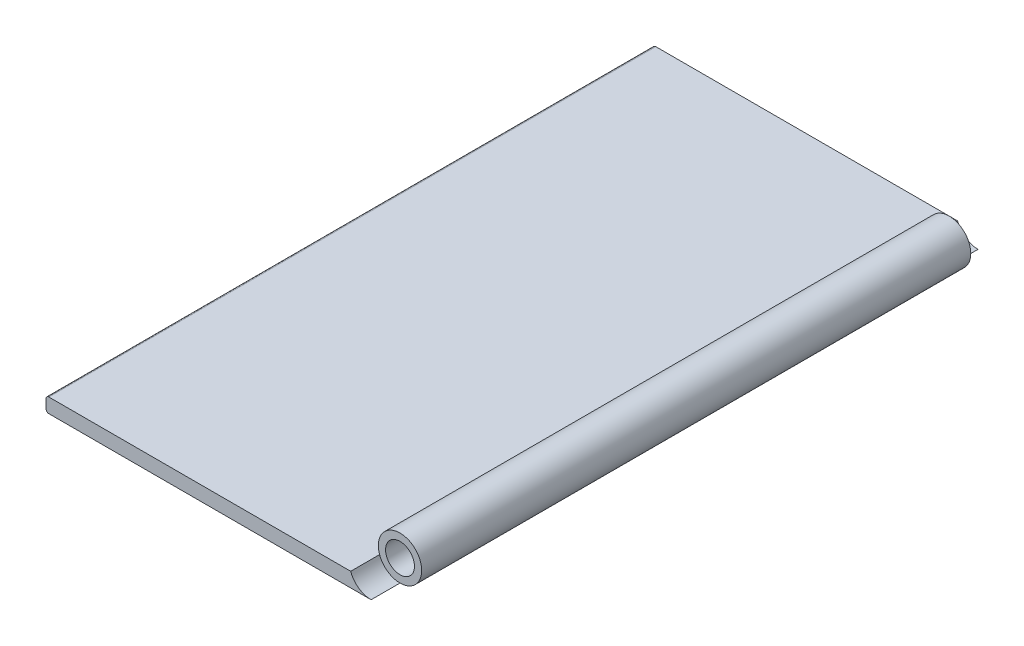
ISO-10303-21;
HEADER;
FILE_DESCRIPTION(('STEP AP214'),'2;1');
FILE_NAME('part.step','',(''),(''),'','','');
FILE_SCHEMA(('AUTOMOTIVE_DESIGN { 1 0 10303 214 1 1 1 1 }'));
ENDSEC;
DATA;
#1=APPLICATION_CONTEXT('core data for automotive mechanical design processes');
#2=APPLICATION_PROTOCOL_DEFINITION('international standard','automotive_design',2000,#1);
#3=PRODUCT_CONTEXT('',#1,'mechanical');
#4=PRODUCT('Part','Part','',(#3));
#5=PRODUCT_RELATED_PRODUCT_CATEGORY('part','',(#4));
#6=PRODUCT_DEFINITION_FORMATION('','',#4);
#7=PRODUCT_DEFINITION_CONTEXT('part definition',#1,'design');
#8=PRODUCT_DEFINITION('design','',#6,#7);
#9=PRODUCT_DEFINITION_SHAPE('','',#8);
#10=(LENGTH_UNIT() NAMED_UNIT(*) SI_UNIT(.MILLI.,.METRE.));
#11=(NAMED_UNIT(*) PLANE_ANGLE_UNIT() SI_UNIT($,.RADIAN.));
#12=(NAMED_UNIT(*) SI_UNIT($,.STERADIAN.) SOLID_ANGLE_UNIT());
#13=UNCERTAINTY_MEASURE_WITH_UNIT(LENGTH_MEASURE(1.E-05),#10,'distance_accuracy_value','');
#14=(GEOMETRIC_REPRESENTATION_CONTEXT(3) GLOBAL_UNCERTAINTY_ASSIGNED_CONTEXT((#13)) GLOBAL_UNIT_ASSIGNED_CONTEXT((#10,
#11,#12)) REPRESENTATION_CONTEXT('',''));
#15=CARTESIAN_POINT('',(0.,0.,0.));
#16=DIRECTION('',(0.,0.,1.));
#17=DIRECTION('',(1.,0.,0.));
#18=AXIS2_PLACEMENT_3D('',#15,#16,#17);
#19=CARTESIAN_POINT('',(112.5,7.5,210.));
#20=DIRECTION('',(0.,0.,-1.));
#21=DIRECTION('',(-1.,0.,0.));
#22=AXIS2_PLACEMENT_3D('',#19,#20,#21);
#23=CYLINDRICAL_SURFACE('',#22,7.50000000000001);
#24=CARTESIAN_POINT('',(112.5,7.5,10.));
#25=DIRECTION('',(0.,0.,-1.));
#26=DIRECTION('',(-1.,0.,0.));
#27=AXIS2_PLACEMENT_3D('',#24,#25,#26);
#28=CIRCLE('',#27,7.50000000000001);
#29=CARTESIAN_POINT('',(105.428932188123,5.00000000003196,10.));
#30=VERTEX_POINT('',#29);
#31=CARTESIAN_POINT('',(112.5,0.,10.));
#32=VERTEX_POINT('',#31);
#33=EDGE_CURVE('E158',#30,#32,#28,.T.);
#34=ORIENTED_EDGE('',*,*,#33,.F.);
#35=DIRECTION('',(0.,0.,-1.));
#36=VECTOR('',#35,1.);
#37=CARTESIAN_POINT('',(105.428932188123,5.00000000003196,210.));
#38=LINE('',#37,#36);
#39=CARTESIAN_POINT('',(105.428932188123,5.00000000003196,200.));
#40=VERTEX_POINT('',#39);
#41=EDGE_CURVE('E135',#40,#30,#38,.T.);
#42=ORIENTED_EDGE('',*,*,#41,.F.);
#43=CARTESIAN_POINT('',(112.5,7.5,200.));
#44=DIRECTION('',(0.,0.,1.));
#45=DIRECTION('',(1.,0.,0.));
#46=AXIS2_PLACEMENT_3D('',#43,#44,#45);
#47=CIRCLE('',#46,7.50000000000001);
#48=CARTESIAN_POINT('',(112.5,0.,200.));
#49=VERTEX_POINT('',#48);
#50=EDGE_CURVE('E155',#49,#40,#47,.T.);
#51=ORIENTED_EDGE('',*,*,#50,.F.);
#52=DIRECTION('',(0.,0.,-1.));
#53=VECTOR('',#52,1.);
#54=CARTESIAN_POINT('',(112.5,0.,210.));
#55=LINE('',#54,#53);
#56=EDGE_CURVE('E45',#49,#32,#55,.T.);
#57=ORIENTED_EDGE('',*,*,#56,.T.);
#58=EDGE_LOOP('',(#34,#42,#51,#57));
#59=FACE_BOUND('',#58,.T.);
#60=ADVANCED_FACE('F35',(#59),#23,.T.);
#61=CARTESIAN_POINT('',(112.5,7.5,210.));
#62=DIRECTION('',(0.,0.,-1.));
#63=DIRECTION('',(-1.,0.,0.));
#64=AXIS2_PLACEMENT_3D('',#61,#62,#63);
#65=CYLINDRICAL_SURFACE('',#64,5.);
#66=CARTESIAN_POINT('',(112.5,7.5,200.));
#67=DIRECTION('',(0.,0.,1.));
#68=DIRECTION('',(1.,0.,0.));
#69=AXIS2_PLACEMENT_3D('',#66,#67,#68);
#70=CIRCLE('',#69,5.);
#71=CARTESIAN_POINT('',(117.5,7.5,200.));
#72=VERTEX_POINT('',#71);
#73=EDGE_CURVE('E39',#72,#72,#70,.T.);
#74=ORIENTED_EDGE('',*,*,#73,.T.);
#75=EDGE_LOOP('',(#74));
#76=FACE_BOUND('',#75,.T.);
#77=CARTESIAN_POINT('',(112.5,7.5,10.));
#78=DIRECTION('',(0.,0.,-1.));
#79=DIRECTION('',(-1.,0.,0.));
#80=AXIS2_PLACEMENT_3D('',#77,#78,#79);
#81=CIRCLE('',#80,5.);
#82=CARTESIAN_POINT('',(107.5,7.5,10.));
#83=VERTEX_POINT('',#82);
#84=EDGE_CURVE('E178',#83,#83,#81,.T.);
#85=ORIENTED_EDGE('',*,*,#84,.T.);
#86=EDGE_LOOP('',(#85));
#87=FACE_BOUND('',#86,.T.);
#88=ADVANCED_FACE('F203',(#76,#87),#65,.F.);
#89=CARTESIAN_POINT('',(0.,0.,210.));
#90=DIRECTION('',(0.,1.,0.));
#91=DIRECTION('',(0.,0.,1.));
#92=AXIS2_PLACEMENT_3D('',#89,#90,#91);
#93=PLANE('',#92);
#94=DIRECTION('',(1.,0.,0.));
#95=VECTOR('',#94,1.);
#96=CARTESIAN_POINT('',(0.,0.,0.));
#97=LINE('',#96,#95);
#98=CARTESIAN_POINT('',(1.,0.,0.));
#99=VERTEX_POINT('',#98);
#100=CARTESIAN_POINT('',(112.5,0.,0.));
#101=VERTEX_POINT('',#100);
#102=EDGE_CURVE('E120',#99,#101,#97,.T.);
#103=ORIENTED_EDGE('',*,*,#102,.T.);
#104=DIRECTION('',(0.,0.,-1.));
#105=VECTOR('',#104,1.);
#106=CARTESIAN_POINT('',(112.5,0.,10.));
#107=LINE('',#106,#105);
#108=EDGE_CURVE('E175',#32,#101,#107,.T.);
#109=ORIENTED_EDGE('',*,*,#108,.F.);
#110=ORIENTED_EDGE('',*,*,#56,.F.);
#111=CARTESIAN_POINT('',(112.5,0.,210.));
#112=VERTEX_POINT('',#111);
#113=EDGE_CURVE('E11',#112,#49,#55,.T.);
#114=ORIENTED_EDGE('',*,*,#113,.F.);
#115=DIRECTION('',(1.,0.,0.));
#116=VECTOR('',#115,1.);
#117=CARTESIAN_POINT('',(0.,0.,210.));
#118=LINE('',#117,#116);
#119=CARTESIAN_POINT('',(1.,0.,210.));
#120=VERTEX_POINT('',#119);
#121=EDGE_CURVE('E131',#120,#112,#118,.T.);
#122=ORIENTED_EDGE('',*,*,#121,.F.);
#123=DIRECTION('',(0.,0.,-1.));
#124=VECTOR('',#123,1.);
#125=CARTESIAN_POINT('',(1.,0.,210.));
#126=LINE('',#125,#124);
#127=EDGE_CURVE('E53',#120,#99,#126,.T.);
#128=ORIENTED_EDGE('',*,*,#127,.T.);
#129=EDGE_LOOP('',(#103,#109,#110,#114,#122,#128));
#130=FACE_BOUND('',#129,.T.);
#131=ADVANCED_FACE('F37',(#130),#93,.F.);
#132=CARTESIAN_POINT('',(0.,5.00000000003196,210.));
#133=DIRECTION('',(0.,1.,0.));
#134=DIRECTION('',(0.,0.,1.));
#135=AXIS2_PLACEMENT_3D('',#132,#133,#134);
#136=PLANE('',#135);
#137=DIRECTION('',(1.,0.,0.));
#138=VECTOR('',#137,1.);
#139=CARTESIAN_POINT('',(0.,5.00000000003196,0.));
#140=LINE('',#139,#138);
#141=CARTESIAN_POINT('',(0.999999999999057,5.00000000003196,0.));
#142=VERTEX_POINT('',#141);
#143=CARTESIAN_POINT('',(105.428932188123,5.00000000003196,0.));
#144=VERTEX_POINT('',#143);
#145=EDGE_CURVE('E122',#142,#144,#140,.T.);
#146=ORIENTED_EDGE('',*,*,#145,.F.);
#147=DIRECTION('',(0.,0.,-1.));
#148=VECTOR('',#147,1.);
#149=CARTESIAN_POINT('',(0.999999999999057,5.00000000003196,210.));
#150=LINE('',#149,#148);
#151=CARTESIAN_POINT('',(0.999999999999057,5.00000000003196,210.));
#152=VERTEX_POINT('',#151);
#153=EDGE_CURVE('E112',#152,#142,#150,.T.);
#154=ORIENTED_EDGE('',*,*,#153,.F.);
#155=DIRECTION('',(1.,0.,0.));
#156=VECTOR('',#155,1.);
#157=CARTESIAN_POINT('',(0.,5.00000000003196,210.));
#158=LINE('',#157,#156);
#159=CARTESIAN_POINT('',(105.428932188123,5.00000000003196,210.));
#160=VERTEX_POINT('',#159);
#161=EDGE_CURVE('E102',#152,#160,#158,.T.);
#162=ORIENTED_EDGE('',*,*,#161,.T.);
#163=EDGE_CURVE('E84',#160,#40,#38,.T.);
#164=ORIENTED_EDGE('',*,*,#163,.T.);
#165=ORIENTED_EDGE('',*,*,#41,.T.);
#166=DIRECTION('',(0.,0.,-1.));
#167=VECTOR('',#166,1.);
#168=CARTESIAN_POINT('',(105.428932188123,5.00000000003196,10.));
#169=LINE('',#168,#167);
#170=EDGE_CURVE('E147',#144,#30,#169,.F.);
#171=ORIENTED_EDGE('',*,*,#170,.F.);
#172=EDGE_LOOP('',(#146,#154,#162,#164,#165,#171));
#173=FACE_BOUND('',#172,.T.);
#174=ADVANCED_FACE('F144',(#173),#136,.T.);
#175=CARTESIAN_POINT('',(0.999999999999985,4.00000000003196,210.));
#176=DIRECTION('',(0.,0.,-1.));
#177=DIRECTION('',(-1.,0.,0.));
#178=AXIS2_PLACEMENT_3D('',#175,#176,#177);
#179=CYLINDRICAL_SURFACE('',#178,1.);
#180=CARTESIAN_POINT('',(0.999999999999985,4.00000000003196,0.));
#181=DIRECTION('',(0.,0.,1.));
#182=DIRECTION('',(1.,0.,0.));
#183=AXIS2_PLACEMENT_3D('',#180,#181,#182);
#184=CIRCLE('',#183,1.);
#185=CARTESIAN_POINT('',(0.,4.00000000003195,0.));
#186=VERTEX_POINT('',#185);
#187=EDGE_CURVE('E109',#142,#186,#184,.T.);
#188=ORIENTED_EDGE('',*,*,#187,.T.);
#189=DIRECTION('',(0.,0.,-1.));
#190=VECTOR('',#189,1.);
#191=CARTESIAN_POINT('',(0.,4.00000000003195,210.));
#192=LINE('',#191,#190);
#193=CARTESIAN_POINT('',(0.,4.00000000003195,210.));
#194=VERTEX_POINT('',#193);
#195=EDGE_CURVE('E106',#194,#186,#192,.T.);
#196=ORIENTED_EDGE('',*,*,#195,.F.);
#197=CARTESIAN_POINT('',(0.999999999999985,4.00000000003196,210.));
#198=DIRECTION('',(0.,0.,1.));
#199=DIRECTION('',(1.,0.,0.));
#200=AXIS2_PLACEMENT_3D('',#197,#198,#199);
#201=CIRCLE('',#200,1.);
#202=EDGE_CURVE('E95',#152,#194,#201,.T.);
#203=ORIENTED_EDGE('',*,*,#202,.F.);
#204=ORIENTED_EDGE('',*,*,#153,.T.);
#205=EDGE_LOOP('',(#188,#196,#203,#204));
#206=FACE_BOUND('',#205,.T.);
#207=ADVANCED_FACE('F107',(#206),#179,.T.);
#208=CARTESIAN_POINT('',(0.,0.,210.));
#209=DIRECTION('',(-1.,0.,0.));
#210=DIRECTION('',(0.,-1.,0.));
#211=AXIS2_PLACEMENT_3D('',#208,#209,#210);
#212=PLANE('',#211);
#213=DIRECTION('',(0.,1.,0.));
#214=VECTOR('',#213,1.);
#215=CARTESIAN_POINT('',(0.,0.,0.));
#216=LINE('',#215,#214);
#217=CARTESIAN_POINT('',(0.,1.,0.));
#218=VERTEX_POINT('',#217);
#219=EDGE_CURVE('E126',#218,#186,#216,.T.);
#220=ORIENTED_EDGE('',*,*,#219,.F.);
#221=DIRECTION('',(0.,0.,-1.));
#222=VECTOR('',#221,1.);
#223=CARTESIAN_POINT('',(0.,1.,210.));
#224=LINE('',#223,#222);
#225=CARTESIAN_POINT('',(0.,1.,210.));
#226=VERTEX_POINT('',#225);
#227=EDGE_CURVE('E71',#226,#218,#224,.T.);
#228=ORIENTED_EDGE('',*,*,#227,.F.);
#229=DIRECTION('',(0.,1.,0.));
#230=VECTOR('',#229,1.);
#231=CARTESIAN_POINT('',(0.,0.,210.));
#232=LINE('',#231,#230);
#233=EDGE_CURVE('E100',#226,#194,#232,.T.);
#234=ORIENTED_EDGE('',*,*,#233,.T.);
#235=ORIENTED_EDGE('',*,*,#195,.T.);
#236=EDGE_LOOP('',(#220,#228,#234,#235));
#237=FACE_BOUND('',#236,.T.);
#238=ADVANCED_FACE('F114',(#237),#212,.T.);
#239=CARTESIAN_POINT('',(0.999999999999996,1.,210.));
#240=DIRECTION('',(0.,0.,-1.));
#241=DIRECTION('',(-1.,0.,0.));
#242=AXIS2_PLACEMENT_3D('',#239,#240,#241);
#243=CYLINDRICAL_SURFACE('',#242,1.);
#244=CARTESIAN_POINT('',(0.999999999999996,1.,0.));
#245=DIRECTION('',(0.,0.,1.));
#246=DIRECTION('',(1.,0.,0.));
#247=AXIS2_PLACEMENT_3D('',#244,#245,#246);
#248=CIRCLE('',#247,1.);
#249=EDGE_CURVE('E128',#99,#218,#248,.F.);
#250=ORIENTED_EDGE('',*,*,#249,.F.);
#251=ORIENTED_EDGE('',*,*,#127,.F.);
#252=CARTESIAN_POINT('',(0.999999999999996,1.,210.));
#253=DIRECTION('',(0.,0.,1.));
#254=DIRECTION('',(1.,0.,0.));
#255=AXIS2_PLACEMENT_3D('',#252,#253,#254);
#256=CIRCLE('',#255,1.);
#257=EDGE_CURVE('E115',#120,#226,#256,.F.);
#258=ORIENTED_EDGE('',*,*,#257,.T.);
#259=ORIENTED_EDGE('',*,*,#227,.T.);
#260=EDGE_LOOP('',(#250,#251,#258,#259));
#261=FACE_BOUND('',#260,.T.);
#262=ADVANCED_FACE('F192',(#261),#243,.T.);
#263=CARTESIAN_POINT('',(0.,0.,210.));
#264=DIRECTION('',(0.,0.,1.));
#265=DIRECTION('',(1.,0.,0.));
#266=AXIS2_PLACEMENT_3D('',#263,#264,#265);
#267=PLANE('',#266);
#268=CARTESIAN_POINT('',(112.5,7.5,210.));
#269=DIRECTION('',(0.,0.,1.));
#270=DIRECTION('',(1.,0.,0.));
#271=AXIS2_PLACEMENT_3D('',#268,#269,#270);
#272=CIRCLE('',#271,7.50000000000001);
#273=EDGE_CURVE('E181',#160,#112,#272,.T.);
#274=ORIENTED_EDGE('',*,*,#273,.F.);
#275=ORIENTED_EDGE('',*,*,#161,.F.);
#276=ORIENTED_EDGE('',*,*,#202,.T.);
#277=ORIENTED_EDGE('',*,*,#233,.F.);
#278=ORIENTED_EDGE('',*,*,#257,.F.);
#279=ORIENTED_EDGE('',*,*,#121,.T.);
#280=EDGE_LOOP('',(#274,#275,#276,#277,#278,#279));
#281=FACE_BOUND('',#280,.T.);
#282=ADVANCED_FACE('F97',(#281),#267,.T.);
#283=CARTESIAN_POINT('',(0.,0.,0.));
#284=DIRECTION('',(0.,0.,1.));
#285=DIRECTION('',(1.,0.,0.));
#286=AXIS2_PLACEMENT_3D('',#283,#284,#285);
#287=PLANE('',#286);
#288=ORIENTED_EDGE('',*,*,#145,.T.);
#289=CARTESIAN_POINT('',(112.5,7.5,0.));
#290=DIRECTION('',(0.,0.,-1.));
#291=DIRECTION('',(-1.,0.,0.));
#292=AXIS2_PLACEMENT_3D('',#289,#290,#291);
#293=CIRCLE('',#292,7.50000000000001);
#294=EDGE_CURVE('E170',#101,#144,#293,.T.);
#295=ORIENTED_EDGE('',*,*,#294,.F.);
#296=ORIENTED_EDGE('',*,*,#102,.F.);
#297=ORIENTED_EDGE('',*,*,#249,.T.);
#298=ORIENTED_EDGE('',*,*,#219,.T.);
#299=ORIENTED_EDGE('',*,*,#187,.F.);
#300=EDGE_LOOP('',(#288,#295,#296,#297,#298,#299));
#301=FACE_BOUND('',#300,.T.);
#302=ADVANCED_FACE('F191',(#301),#287,.F.);
#303=CARTESIAN_POINT('',(112.5,7.5,200.));
#304=DIRECTION('',(0.,0.,1.));
#305=DIRECTION('',(1.,0.,0.));
#306=AXIS2_PLACEMENT_3D('',#303,#304,#305);
#307=CYLINDRICAL_SURFACE('',#306,7.50000000000001);
#308=EDGE_CURVE('E186',#40,#49,#47,.T.);
#309=ORIENTED_EDGE('',*,*,#308,.F.);
#310=ORIENTED_EDGE('',*,*,#163,.F.);
#311=ORIENTED_EDGE('',*,*,#273,.T.);
#312=ORIENTED_EDGE('',*,*,#113,.T.);
#313=EDGE_LOOP('',(#309,#310,#311,#312));
#314=FACE_BOUND('',#313,.T.);
#315=ADVANCED_FACE('F240',(#314),#307,.F.);
#316=CARTESIAN_POINT('',(112.5,7.5,200.));
#317=DIRECTION('',(0.,0.,1.));
#318=DIRECTION('',(1.,0.,0.));
#319=AXIS2_PLACEMENT_3D('',#316,#317,#318);
#320=PLANE('',#319);
#321=ORIENTED_EDGE('',*,*,#73,.F.);
#322=EDGE_LOOP('',(#321));
#323=FACE_BOUND('',#322,.T.);
#324=ORIENTED_EDGE('',*,*,#308,.T.);
#325=ORIENTED_EDGE('',*,*,#50,.T.);
#326=EDGE_LOOP('',(#324,#325));
#327=FACE_BOUND('',#326,.T.);
#328=ADVANCED_FACE('F245',(#323,#327),#320,.T.);
#329=CARTESIAN_POINT('',(112.5,7.5,10.));
#330=DIRECTION('',(0.,0.,-1.));
#331=DIRECTION('',(-1.,0.,0.));
#332=AXIS2_PLACEMENT_3D('',#329,#330,#331);
#333=CYLINDRICAL_SURFACE('',#332,7.50000000000001);
#334=ORIENTED_EDGE('',*,*,#108,.T.);
#335=ORIENTED_EDGE('',*,*,#294,.T.);
#336=ORIENTED_EDGE('',*,*,#170,.T.);
#337=EDGE_CURVE('E169',#32,#30,#28,.T.);
#338=ORIENTED_EDGE('',*,*,#337,.F.);
#339=EDGE_LOOP('',(#334,#335,#336,#338));
#340=FACE_BOUND('',#339,.T.);
#341=ADVANCED_FACE('F174',(#340),#333,.F.);
#342=CARTESIAN_POINT('',(112.5,7.5,10.));
#343=DIRECTION('',(0.,0.,-1.));
#344=DIRECTION('',(-1.,0.,0.));
#345=AXIS2_PLACEMENT_3D('',#342,#343,#344);
#346=PLANE('',#345);
#347=ORIENTED_EDGE('',*,*,#84,.F.);
#348=EDGE_LOOP('',(#347));
#349=FACE_BOUND('',#348,.T.);
#350=ORIENTED_EDGE('',*,*,#337,.T.);
#351=ORIENTED_EDGE('',*,*,#33,.T.);
#352=EDGE_LOOP('',(#350,#351));
#353=FACE_BOUND('',#352,.T.);
#354=ADVANCED_FACE('F168',(#349,#353),#346,.T.);
#355=CLOSED_SHELL('',(#60,#88,#131,#174,#207,#238,#262,#282,#302,#315,#328,#341,#354));
#356=MANIFOLD_SOLID_BREP('B2',#355);
#357=ADVANCED_BREP_SHAPE_REPRESENTATION('',(#18,#356),#14);
#358=SHAPE_DEFINITION_REPRESENTATION(#9,#357);
ENDSEC;
END-ISO-10303-21;
